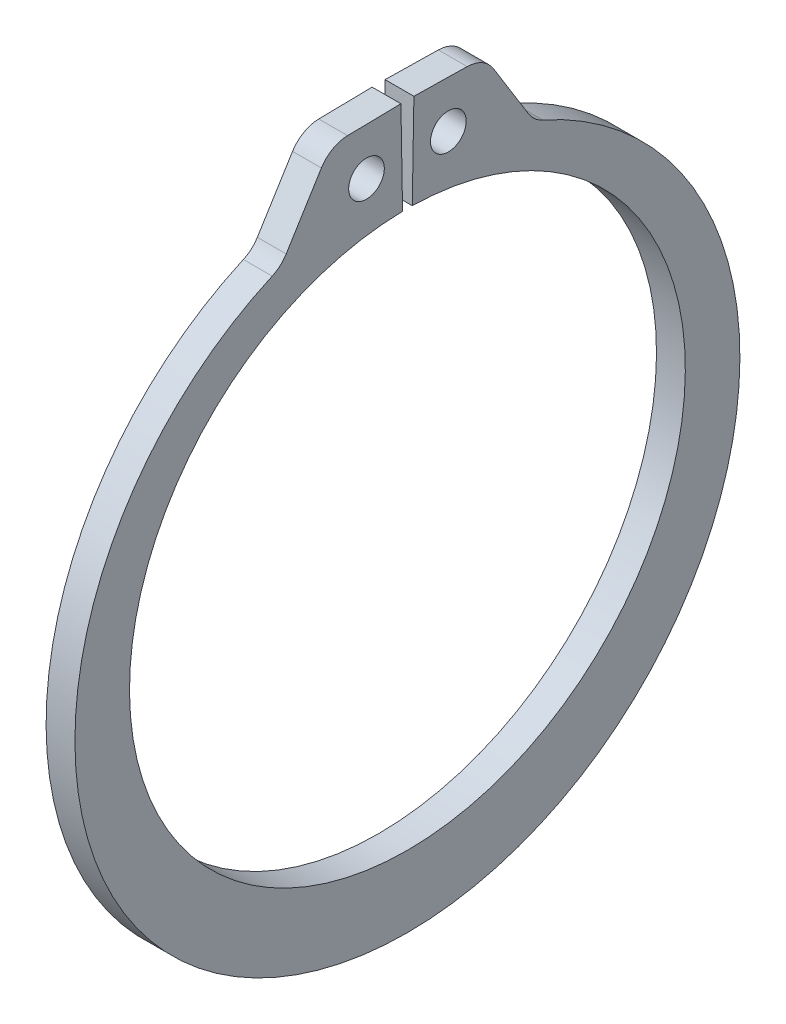
ISO-10303-21;
HEADER;
FILE_DESCRIPTION(('STEP AP214'),'2;1');
FILE_NAME('part.step','',(''),(''),'','','');
FILE_SCHEMA(('AUTOMOTIVE_DESIGN { 1 0 10303 214 1 1 1 1 }'));
ENDSEC;
DATA;
#1=APPLICATION_CONTEXT('core data for automotive mechanical design processes');
#2=APPLICATION_PROTOCOL_DEFINITION('international standard','automotive_design',2000,#1);
#3=PRODUCT_CONTEXT('',#1,'mechanical');
#4=PRODUCT('Part','Part','',(#3));
#5=PRODUCT_RELATED_PRODUCT_CATEGORY('part','',(#4));
#6=PRODUCT_DEFINITION_FORMATION('','',#4);
#7=PRODUCT_DEFINITION_CONTEXT('part definition',#1,'design');
#8=PRODUCT_DEFINITION('design','',#6,#7);
#9=PRODUCT_DEFINITION_SHAPE('','',#8);
#10=(LENGTH_UNIT() NAMED_UNIT(*) SI_UNIT(.MILLI.,.METRE.));
#11=(NAMED_UNIT(*) PLANE_ANGLE_UNIT() SI_UNIT($,.RADIAN.));
#12=(NAMED_UNIT(*) SI_UNIT($,.STERADIAN.) SOLID_ANGLE_UNIT());
#13=UNCERTAINTY_MEASURE_WITH_UNIT(LENGTH_MEASURE(1.E-05),#10,'distance_accuracy_value','');
#14=(GEOMETRIC_REPRESENTATION_CONTEXT(3) GLOBAL_UNCERTAINTY_ASSIGNED_CONTEXT((#13)) GLOBAL_UNIT_ASSIGNED_CONTEXT((#10,
#11,#12)) REPRESENTATION_CONTEXT('',''));
#15=CARTESIAN_POINT('',(0.,0.,0.));
#16=DIRECTION('',(0.,0.,1.));
#17=DIRECTION('',(1.,0.,0.));
#18=AXIS2_PLACEMENT_3D('',#15,#16,#17);
#19=CARTESIAN_POINT('',(0.5334,0.,0.));
#20=DIRECTION('',(1.,0.,0.));
#21=DIRECTION('',(0.,0.,-1.));
#22=AXIS2_PLACEMENT_3D('',#19,#20,#21);
#23=PLANE('',#22);
#24=CARTESIAN_POINT('',(0.5334,12.0022941634062,1.5146246005825));
#25=DIRECTION('',(1.,0.,0.));
#26=DIRECTION('',(0.,0.,-1.));
#27=AXIS2_PLACEMENT_3D('',#24,#25,#26);
#28=CIRCLE('',#27,0.6604);
#29=CARTESIAN_POINT('',(0.5334,12.0022941634062,0.8542246005825));
#30=VERTEX_POINT('',#29);
#31=EDGE_CURVE('E218',#30,#30,#28,.T.);
#32=ORIENTED_EDGE('',*,*,#31,.F.);
#33=EDGE_LOOP('',(#32));
#34=FACE_BOUND('',#33,.T.);
#35=DIRECTION('',(0.,-0.0174524064372796,0.999847695156391));
#36=VECTOR('',#35,1.);
#37=CARTESIAN_POINT('',(0.5334,13.764703249679,0.240263788940795));
#38=LINE('',#37,#36);
#39=CARTESIAN_POINT('',(0.5334,13.764703249679,0.240263788940795));
#40=VERTEX_POINT('',#39);
#41=CARTESIAN_POINT('',(0.5334,13.7302813096865,2.2122954103674));
#42=VERTEX_POINT('',#41);
#43=EDGE_CURVE('E130',#40,#42,#38,.T.);
#44=ORIENTED_EDGE('',*,*,#43,.T.);
#45=CARTESIAN_POINT('',(0.5334,12.5620592626658,2.19190401868609));
#46=DIRECTION('',(1.,0.,0.));
#47=DIRECTION('',(0.,0.,-1.));
#48=AXIS2_PLACEMENT_3D('',#45,#46,#47);
#49=CIRCLE('',#48,1.1684);
#50=CARTESIAN_POINT('',(0.5334,13.1771180937849,3.1853128943573));
#51=VERTEX_POINT('',#50);
#52=EDGE_CURVE('E171',#42,#51,#49,.T.);
#53=ORIENTED_EDGE('',*,*,#52,.T.);
#54=DIRECTION('',(0.,-0.850230122964068,0.526411187195434));
#55=VECTOR('',#54,1.);
#56=CARTESIAN_POINT('',(0.5334,13.7191550867387,2.8497162961447));
#57=LINE('',#56,#55);
#58=CARTESIAN_POINT('',(0.5334,11.0741234414696,4.48736028328253));
#59=VERTEX_POINT('',#58);
#60=EDGE_CURVE('E210',#51,#59,#57,.T.);
#61=ORIENTED_EDGE('',*,*,#60,.T.);
#62=CARTESIAN_POINT('',(0.5334,11.6891822725888,5.48076915895375));
#63=DIRECTION('',(1.,0.,0.));
#64=DIRECTION('',(0.,0.,-1.));
#65=AXIS2_PLACEMENT_3D('',#62,#63,#64);
#66=CIRCLE('',#65,1.1684);
#67=CARTESIAN_POINT('',(0.5334,10.6217868347989,5.00555811174905));
#68=VERTEX_POINT('',#67);
#69=EDGE_CURVE('E178',#59,#68,#66,.F.);
#70=ORIENTED_EDGE('',*,*,#69,.T.);
#71=CARTESIAN_POINT('',(0.5334,-0.621449035876219,0.));
#72=DIRECTION('',(1.,0.,0.));
#73=DIRECTION('',(0.,0.,-1.));
#74=AXIS2_PLACEMENT_3D('',#71,#72,#73);
#75=CIRCLE('',#74,12.3071509641238);
#76=CARTESIAN_POINT('',(0.5334,10.6217868347989,-5.00555811174905));
#77=VERTEX_POINT('',#76);
#78=EDGE_CURVE('E203',#68,#77,#75,.T.);
#79=ORIENTED_EDGE('',*,*,#78,.T.);
#80=CARTESIAN_POINT('',(0.5334,11.6891822725888,-5.48076915895375));
#81=DIRECTION('',(1.,0.,0.));
#82=DIRECTION('',(0.,0.,-1.));
#83=AXIS2_PLACEMENT_3D('',#80,#81,#82);
#84=CIRCLE('',#83,1.1684);
#85=CARTESIAN_POINT('',(0.5334,11.0741234414696,-4.48736028328253));
#86=VERTEX_POINT('',#85);
#87=EDGE_CURVE('E11',#77,#86,#84,.F.);
#88=ORIENTED_EDGE('',*,*,#87,.T.);
#89=DIRECTION('',(0.,0.850230122964068,0.526411187195434));
#90=VECTOR('',#89,1.);
#91=CARTESIAN_POINT('',(0.5334,13.7191550867387,-2.8497162961447));
#92=LINE('',#91,#90);
#93=CARTESIAN_POINT('',(0.5334,13.1771180937849,-3.1853128943573));
#94=VERTEX_POINT('',#93);
#95=EDGE_CURVE('E202',#86,#94,#92,.T.);
#96=ORIENTED_EDGE('',*,*,#95,.T.);
#97=CARTESIAN_POINT('',(0.5334,12.5620592626658,-2.19190401868609));
#98=DIRECTION('',(1.,0.,0.));
#99=DIRECTION('',(0.,0.,-1.));
#100=AXIS2_PLACEMENT_3D('',#97,#98,#99);
#101=CIRCLE('',#100,1.1684);
#102=CARTESIAN_POINT('',(0.5334,13.7302813096865,-2.2122954103674));
#103=VERTEX_POINT('',#102);
#104=EDGE_CURVE('E46',#94,#103,#101,.T.);
#105=ORIENTED_EDGE('',*,*,#104,.T.);
#106=DIRECTION('',(0.,0.0174524064372796,0.999847695156391));
#107=VECTOR('',#106,1.);
#108=CARTESIAN_POINT('',(0.5334,13.764703249679,-0.240263788940795));
#109=LINE('',#108,#107);
#110=CARTESIAN_POINT('',(0.5334,13.764703249679,-0.240263788940795));
#111=VERTEX_POINT('',#110);
#112=EDGE_CURVE('E207',#103,#111,#109,.T.);
#113=ORIENTED_EDGE('',*,*,#112,.T.);
#114=DIRECTION('',(0.,-0.999847695156391,0.0174524064372834));
#115=VECTOR('',#114,1.);
#116=CARTESIAN_POINT('',(0.5334,10.2854332400738,-0.179532905020336));
#117=LINE('',#116,#115);
#118=CARTESIAN_POINT('',(0.5334,10.2854332400738,-0.179532905020336));
#119=VERTEX_POINT('',#118);
#120=EDGE_CURVE('E136',#111,#119,#117,.T.);
#121=ORIENTED_EDGE('',*,*,#120,.T.);
#122=CARTESIAN_POINT('',(0.5334,0.,0.));
#123=DIRECTION('',(-1.,0.,0.));
#124=DIRECTION('',(0.,0.,-1.));
#125=AXIS2_PLACEMENT_3D('',#122,#123,#124);
#126=CIRCLE('',#125,10.287);
#127=CARTESIAN_POINT('',(0.5334,10.2854332400738,0.179532905020336));
#128=VERTEX_POINT('',#127);
#129=EDGE_CURVE('E131',#119,#128,#126,.T.);
#130=ORIENTED_EDGE('',*,*,#129,.T.);
#131=DIRECTION('',(0.,0.999847695156391,0.0174524064372834));
#132=VECTOR('',#131,1.);
#133=CARTESIAN_POINT('',(0.5334,10.2854332400738,0.179532905020336));
#134=LINE('',#133,#132);
#135=EDGE_CURVE('E122',#128,#40,#134,.T.);
#136=ORIENTED_EDGE('',*,*,#135,.T.);
#137=EDGE_LOOP('',(#44,#53,#61,#70,#79,#88,#96,#105,#113,#121,#130,#136));
#138=FACE_BOUND('',#137,.T.);
#139=CARTESIAN_POINT('',(0.5334,12.0022941634062,-1.5146246005825));
#140=DIRECTION('',(1.,0.,0.));
#141=DIRECTION('',(0.,0.,-1.));
#142=AXIS2_PLACEMENT_3D('',#139,#140,#141);
#143=CIRCLE('',#142,0.6604);
#144=CARTESIAN_POINT('',(0.5334,12.0022941634062,-2.1750246005825));
#145=VERTEX_POINT('',#144);
#146=EDGE_CURVE('E244',#145,#145,#143,.T.);
#147=ORIENTED_EDGE('',*,*,#146,.F.);
#148=EDGE_LOOP('',(#147));
#149=FACE_BOUND('',#148,.T.);
#150=ADVANCED_FACE('F31',(#34,#138,#149),#23,.T.);
#151=CARTESIAN_POINT('',(-0.5334,0.,0.));
#152=DIRECTION('',(1.,0.,0.));
#153=DIRECTION('',(0.,0.,-1.));
#154=AXIS2_PLACEMENT_3D('',#151,#152,#153);
#155=PLANE('',#154);
#156=CARTESIAN_POINT('',(-0.5334,12.0022941634062,1.5146246005825));
#157=DIRECTION('',(1.,0.,0.));
#158=DIRECTION('',(0.,0.,-1.));
#159=AXIS2_PLACEMENT_3D('',#156,#157,#158);
#160=CIRCLE('',#159,0.6604);
#161=CARTESIAN_POINT('',(-0.5334,12.0022941634062,0.8542246005825));
#162=VERTEX_POINT('',#161);
#163=EDGE_CURVE('E241',#162,#162,#160,.T.);
#164=ORIENTED_EDGE('',*,*,#163,.T.);
#165=EDGE_LOOP('',(#164));
#166=FACE_BOUND('',#165,.T.);
#167=DIRECTION('',(0.,-0.850230122964068,0.526411187195434));
#168=VECTOR('',#167,1.);
#169=CARTESIAN_POINT('',(-0.5334,13.7191550867387,2.8497162961447));
#170=LINE('',#169,#168);
#171=CARTESIAN_POINT('',(-0.5334,13.1771180937849,3.1853128943573));
#172=VERTEX_POINT('',#171);
#173=CARTESIAN_POINT('',(-0.5334,11.0741234414696,4.48736028328253));
#174=VERTEX_POINT('',#173);
#175=EDGE_CURVE('E197',#172,#174,#170,.T.);
#176=ORIENTED_EDGE('',*,*,#175,.F.);
#177=CARTESIAN_POINT('',(-0.5334,12.5620592626658,2.19190401868609));
#178=DIRECTION('',(1.,0.,0.));
#179=DIRECTION('',(0.,0.,-1.));
#180=AXIS2_PLACEMENT_3D('',#177,#178,#179);
#181=CIRCLE('',#180,1.1684);
#182=CARTESIAN_POINT('',(-0.5334,13.7302813096865,2.2122954103674));
#183=VERTEX_POINT('',#182);
#184=EDGE_CURVE('E167',#172,#183,#181,.F.);
#185=ORIENTED_EDGE('',*,*,#184,.T.);
#186=DIRECTION('',(0.,-0.0174524064372796,0.999847695156391));
#187=VECTOR('',#186,1.);
#188=CARTESIAN_POINT('',(-0.5334,13.764703249679,0.240263788940795));
#189=LINE('',#188,#187);
#190=CARTESIAN_POINT('',(-0.5334,13.764703249679,0.240263788940795));
#191=VERTEX_POINT('',#190);
#192=EDGE_CURVE('E220',#191,#183,#189,.T.);
#193=ORIENTED_EDGE('',*,*,#192,.F.);
#194=DIRECTION('',(0.,0.999847695156391,0.0174524064372834));
#195=VECTOR('',#194,1.);
#196=CARTESIAN_POINT('',(-0.5334,10.2854332400738,0.179532905020336));
#197=LINE('',#196,#195);
#198=CARTESIAN_POINT('',(-0.5334,10.2854332400738,0.179532905020336));
#199=VERTEX_POINT('',#198);
#200=EDGE_CURVE('E217',#199,#191,#197,.T.);
#201=ORIENTED_EDGE('',*,*,#200,.F.);
#202=CARTESIAN_POINT('',(-0.5334,0.,0.));
#203=DIRECTION('',(-1.,0.,0.));
#204=DIRECTION('',(0.,0.,-1.));
#205=AXIS2_PLACEMENT_3D('',#202,#203,#204);
#206=CIRCLE('',#205,10.287);
#207=CARTESIAN_POINT('',(-0.5334,10.2854332400738,-0.179532905020336));
#208=VERTEX_POINT('',#207);
#209=EDGE_CURVE('E144',#208,#199,#206,.T.);
#210=ORIENTED_EDGE('',*,*,#209,.F.);
#211=DIRECTION('',(0.,-0.999847695156391,0.0174524064372834));
#212=VECTOR('',#211,1.);
#213=CARTESIAN_POINT('',(-0.5334,10.2854332400738,-0.179532905020336));
#214=LINE('',#213,#212);
#215=CARTESIAN_POINT('',(-0.5334,13.764703249679,-0.240263788940795));
#216=VERTEX_POINT('',#215);
#217=EDGE_CURVE('E140',#216,#208,#214,.T.);
#218=ORIENTED_EDGE('',*,*,#217,.F.);
#219=DIRECTION('',(0.,0.0174524064372796,0.999847695156391));
#220=VECTOR('',#219,1.);
#221=CARTESIAN_POINT('',(-0.5334,13.764703249679,-0.240263788940795));
#222=LINE('',#221,#220);
#223=CARTESIAN_POINT('',(-0.5334,13.7302813096865,-2.2122954103674));
#224=VERTEX_POINT('',#223);
#225=EDGE_CURVE('E225',#224,#216,#222,.T.);
#226=ORIENTED_EDGE('',*,*,#225,.F.);
#227=CARTESIAN_POINT('',(-0.5334,12.5620592626658,-2.19190401868609));
#228=DIRECTION('',(1.,0.,0.));
#229=DIRECTION('',(0.,0.,-1.));
#230=AXIS2_PLACEMENT_3D('',#227,#228,#229);
#231=CIRCLE('',#230,1.1684);
#232=CARTESIAN_POINT('',(-0.5334,13.1771180937849,-3.1853128943573));
#233=VERTEX_POINT('',#232);
#234=EDGE_CURVE('E165',#224,#233,#231,.F.);
#235=ORIENTED_EDGE('',*,*,#234,.T.);
#236=DIRECTION('',(0.,0.850230122964068,0.526411187195434));
#237=VECTOR('',#236,1.);
#238=CARTESIAN_POINT('',(-0.5334,13.7191550867387,-2.8497162961447));
#239=LINE('',#238,#237);
#240=CARTESIAN_POINT('',(-0.5334,11.0741234414696,-4.48736028328253));
#241=VERTEX_POINT('',#240);
#242=EDGE_CURVE('E188',#241,#233,#239,.T.);
#243=ORIENTED_EDGE('',*,*,#242,.F.);
#244=CARTESIAN_POINT('',(-0.5334,11.6891822725888,-5.48076915895375));
#245=DIRECTION('',(1.,0.,0.));
#246=DIRECTION('',(0.,0.,-1.));
#247=AXIS2_PLACEMENT_3D('',#244,#245,#246);
#248=CIRCLE('',#247,1.1684);
#249=CARTESIAN_POINT('',(-0.5334,10.6217868347989,-5.00555811174905));
#250=VERTEX_POINT('',#249);
#251=EDGE_CURVE('E39',#241,#250,#248,.T.);
#252=ORIENTED_EDGE('',*,*,#251,.T.);
#253=CARTESIAN_POINT('',(-0.5334,-0.621449035876219,0.));
#254=DIRECTION('',(1.,0.,0.));
#255=DIRECTION('',(0.,0.,-1.));
#256=AXIS2_PLACEMENT_3D('',#253,#254,#255);
#257=CIRCLE('',#256,12.3071509641238);
#258=CARTESIAN_POINT('',(-0.5334,10.6217868347989,5.00555811174905));
#259=VERTEX_POINT('',#258);
#260=EDGE_CURVE('E186',#259,#250,#257,.T.);
#261=ORIENTED_EDGE('',*,*,#260,.F.);
#262=CARTESIAN_POINT('',(-0.5334,11.6891822725888,5.48076915895375));
#263=DIRECTION('',(1.,0.,0.));
#264=DIRECTION('',(0.,0.,-1.));
#265=AXIS2_PLACEMENT_3D('',#262,#263,#264);
#266=CIRCLE('',#265,1.1684);
#267=EDGE_CURVE('E176',#259,#174,#266,.T.);
#268=ORIENTED_EDGE('',*,*,#267,.T.);
#269=EDGE_LOOP('',(#176,#185,#193,#201,#210,#218,#226,#235,#243,#252,#261,#268));
#270=FACE_BOUND('',#269,.T.);
#271=CARTESIAN_POINT('',(-0.5334,12.0022941634062,-1.5146246005825));
#272=DIRECTION('',(1.,0.,0.));
#273=DIRECTION('',(0.,0.,-1.));
#274=AXIS2_PLACEMENT_3D('',#271,#272,#273);
#275=CIRCLE('',#274,0.6604);
#276=CARTESIAN_POINT('',(-0.5334,12.0022941634062,-2.1750246005825));
#277=VERTEX_POINT('',#276);
#278=EDGE_CURVE('E247',#277,#277,#275,.T.);
#279=ORIENTED_EDGE('',*,*,#278,.T.);
#280=EDGE_LOOP('',(#279));
#281=FACE_BOUND('',#280,.T.);
#282=ADVANCED_FACE('F184',(#166,#270,#281),#155,.F.);
#283=CARTESIAN_POINT('',(0.5334,0.,0.));
#284=DIRECTION('',(-1.,0.,0.));
#285=DIRECTION('',(0.,0.,1.));
#286=AXIS2_PLACEMENT_3D('',#283,#284,#285);
#287=CYLINDRICAL_SURFACE('',#286,10.287);
#288=ORIENTED_EDGE('',*,*,#209,.T.);
#289=DIRECTION('',(-1.,0.,0.));
#290=VECTOR('',#289,1.);
#291=CARTESIAN_POINT('',(0.5334,10.2854332400738,0.179532905020336));
#292=LINE('',#291,#290);
#293=EDGE_CURVE('E126',#128,#199,#292,.T.);
#294=ORIENTED_EDGE('',*,*,#293,.F.);
#295=ORIENTED_EDGE('',*,*,#129,.F.);
#296=DIRECTION('',(-1.,0.,0.));
#297=VECTOR('',#296,1.);
#298=CARTESIAN_POINT('',(0.5334,10.2854332400738,-0.179532905020336));
#299=LINE('',#298,#297);
#300=EDGE_CURVE('E215',#119,#208,#299,.T.);
#301=ORIENTED_EDGE('',*,*,#300,.T.);
#302=EDGE_LOOP('',(#288,#294,#295,#301));
#303=FACE_BOUND('',#302,.T.);
#304=ADVANCED_FACE('F142',(#303),#287,.F.);
#305=CARTESIAN_POINT('',(0.5334,10.2854332400738,0.179532905020336));
#306=DIRECTION('',(0.,-0.0174524064372834,0.999847695156391));
#307=DIRECTION('',(0.,-0.999847695156391,-0.0174524064372834));
#308=AXIS2_PLACEMENT_3D('',#305,#306,#307);
#309=PLANE('',#308);
#310=ORIENTED_EDGE('',*,*,#200,.T.);
#311=DIRECTION('',(-1.,0.,0.));
#312=VECTOR('',#311,1.);
#313=CARTESIAN_POINT('',(0.5334,13.764703249679,0.240263788940795));
#314=LINE('',#313,#312);
#315=EDGE_CURVE('E129',#40,#191,#314,.T.);
#316=ORIENTED_EDGE('',*,*,#315,.F.);
#317=ORIENTED_EDGE('',*,*,#135,.F.);
#318=ORIENTED_EDGE('',*,*,#293,.T.);
#319=EDGE_LOOP('',(#310,#316,#317,#318));
#320=FACE_BOUND('',#319,.T.);
#321=ADVANCED_FACE('F124',(#320),#309,.F.);
#322=CARTESIAN_POINT('',(0.5334,13.764703249679,0.240263788940795));
#323=DIRECTION('',(0.,-0.999847695156391,-0.0174524064372796));
#324=DIRECTION('',(0.,0.0174524064372796,-0.999847695156391));
#325=AXIS2_PLACEMENT_3D('',#322,#323,#324);
#326=PLANE('',#325);
#327=ORIENTED_EDGE('',*,*,#192,.T.);
#328=DIRECTION('',(-1.,0.,0.));
#329=VECTOR('',#328,1.);
#330=CARTESIAN_POINT('',(0.5334,13.7302813096865,2.2122954103674));
#331=LINE('',#330,#329);
#332=EDGE_CURVE('E54',#183,#42,#331,.F.);
#333=ORIENTED_EDGE('',*,*,#332,.T.);
#334=ORIENTED_EDGE('',*,*,#43,.F.);
#335=ORIENTED_EDGE('',*,*,#315,.T.);
#336=EDGE_LOOP('',(#327,#333,#334,#335));
#337=FACE_BOUND('',#336,.T.);
#338=ADVANCED_FACE('F236',(#337),#326,.F.);
#339=CARTESIAN_POINT('',(0.5334,13.7191550867387,2.8497162961447));
#340=DIRECTION('',(0.,-0.526411187195434,-0.850230122964068));
#341=DIRECTION('',(0.,0.850230122964068,-0.526411187195434));
#342=AXIS2_PLACEMENT_3D('',#339,#340,#341);
#343=PLANE('',#342);
#344=ORIENTED_EDGE('',*,*,#175,.T.);
#345=DIRECTION('',(1.,0.,0.));
#346=VECTOR('',#345,1.);
#347=CARTESIAN_POINT('',(0.5334,11.0741234414696,4.48736028328253));
#348=LINE('',#347,#346);
#349=EDGE_CURVE('E158',#174,#59,#348,.T.);
#350=ORIENTED_EDGE('',*,*,#349,.T.);
#351=ORIENTED_EDGE('',*,*,#60,.F.);
#352=DIRECTION('',(-1.,0.,0.));
#353=VECTOR('',#352,1.);
#354=CARTESIAN_POINT('',(0.5334,13.1771180937849,3.1853128943573));
#355=LINE('',#354,#353);
#356=EDGE_CURVE('E155',#51,#172,#355,.T.);
#357=ORIENTED_EDGE('',*,*,#356,.T.);
#358=EDGE_LOOP('',(#344,#350,#351,#357));
#359=FACE_BOUND('',#358,.T.);
#360=ADVANCED_FACE('F277',(#359),#343,.F.);
#361=CARTESIAN_POINT('',(0.5334,-0.621449035876219,0.));
#362=DIRECTION('',(-1.,0.,0.));
#363=DIRECTION('',(0.,0.,1.));
#364=AXIS2_PLACEMENT_3D('',#361,#362,#363);
#365=CYLINDRICAL_SURFACE('',#364,12.3071509641238);
#366=ORIENTED_EDGE('',*,*,#78,.F.);
#367=DIRECTION('',(-1.,0.,0.));
#368=VECTOR('',#367,1.);
#369=CARTESIAN_POINT('',(0.5334,10.6217868347989,5.00555811174905));
#370=LINE('',#369,#368);
#371=EDGE_CURVE('E147',#68,#259,#370,.T.);
#372=ORIENTED_EDGE('',*,*,#371,.T.);
#373=ORIENTED_EDGE('',*,*,#260,.T.);
#374=DIRECTION('',(-1.,0.,0.));
#375=VECTOR('',#374,1.);
#376=CARTESIAN_POINT('',(0.5334,10.6217868347989,-5.00555811174905));
#377=LINE('',#376,#375);
#378=EDGE_CURVE('E145',#250,#77,#377,.F.);
#379=ORIENTED_EDGE('',*,*,#378,.T.);
#380=EDGE_LOOP('',(#366,#372,#373,#379));
#381=FACE_BOUND('',#380,.T.);
#382=ADVANCED_FACE('F194',(#381),#365,.T.);
#383=CARTESIAN_POINT('',(0.5334,13.7191550867387,-2.8497162961447));
#384=DIRECTION('',(0.,-0.526411187195434,0.850230122964068));
#385=DIRECTION('',(0.,-0.850230122964068,-0.526411187195434));
#386=AXIS2_PLACEMENT_3D('',#383,#384,#385);
#387=PLANE('',#386);
#388=ORIENTED_EDGE('',*,*,#95,.F.);
#389=DIRECTION('',(1.,0.,0.));
#390=VECTOR('',#389,1.);
#391=CARTESIAN_POINT('',(-0.5334,11.0741234414696,-4.48736028328253));
#392=LINE('',#391,#390);
#393=EDGE_CURVE('E162',#86,#241,#392,.F.);
#394=ORIENTED_EDGE('',*,*,#393,.T.);
#395=ORIENTED_EDGE('',*,*,#242,.T.);
#396=DIRECTION('',(-1.,0.,0.));
#397=VECTOR('',#396,1.);
#398=CARTESIAN_POINT('',(0.5334,13.1771180937849,-3.1853128943573));
#399=LINE('',#398,#397);
#400=EDGE_CURVE('E160',#233,#94,#399,.F.);
#401=ORIENTED_EDGE('',*,*,#400,.T.);
#402=EDGE_LOOP('',(#388,#394,#395,#401));
#403=FACE_BOUND('',#402,.T.);
#404=ADVANCED_FACE('F205',(#403),#387,.F.);
#405=CARTESIAN_POINT('',(0.5334,13.764703249679,-0.240263788940795));
#406=DIRECTION('',(0.,-0.999847695156391,0.0174524064372796));
#407=DIRECTION('',(0.,-0.0174524064372796,-0.999847695156391));
#408=AXIS2_PLACEMENT_3D('',#405,#406,#407);
#409=PLANE('',#408);
#410=ORIENTED_EDGE('',*,*,#112,.F.);
#411=DIRECTION('',(-1.,0.,0.));
#412=VECTOR('',#411,1.);
#413=CARTESIAN_POINT('',(0.5334,13.7302813096865,-2.2122954103674));
#414=LINE('',#413,#412);
#415=EDGE_CURVE('E173',#103,#224,#414,.T.);
#416=ORIENTED_EDGE('',*,*,#415,.T.);
#417=ORIENTED_EDGE('',*,*,#225,.T.);
#418=DIRECTION('',(-1.,0.,0.));
#419=VECTOR('',#418,1.);
#420=CARTESIAN_POINT('',(0.5334,13.764703249679,-0.240263788940795));
#421=LINE('',#420,#419);
#422=EDGE_CURVE('E149',#111,#216,#421,.T.);
#423=ORIENTED_EDGE('',*,*,#422,.F.);
#424=EDGE_LOOP('',(#410,#416,#417,#423));
#425=FACE_BOUND('',#424,.T.);
#426=ADVANCED_FACE('F270',(#425),#409,.F.);
#427=CARTESIAN_POINT('',(0.5334,10.2854332400738,-0.179532905020336));
#428=DIRECTION('',(0.,-0.0174524064372834,-0.999847695156391));
#429=DIRECTION('',(0.,0.999847695156391,-0.0174524064372834));
#430=AXIS2_PLACEMENT_3D('',#427,#428,#429);
#431=PLANE('',#430);
#432=ORIENTED_EDGE('',*,*,#217,.T.);
#433=ORIENTED_EDGE('',*,*,#300,.F.);
#434=ORIENTED_EDGE('',*,*,#120,.F.);
#435=ORIENTED_EDGE('',*,*,#422,.T.);
#436=EDGE_LOOP('',(#432,#433,#434,#435));
#437=FACE_BOUND('',#436,.T.);
#438=ADVANCED_FACE('F232',(#437),#431,.F.);
#439=CARTESIAN_POINT('',(0.5334,12.0022941634062,1.5146246005825));
#440=DIRECTION('',(-1.,0.,0.));
#441=DIRECTION('',(0.,0.,1.));
#442=AXIS2_PLACEMENT_3D('',#439,#440,#441);
#443=CYLINDRICAL_SURFACE('',#442,0.6604);
#444=ORIENTED_EDGE('',*,*,#31,.T.);
#445=EDGE_LOOP('',(#444));
#446=FACE_BOUND('',#445,.T.);
#447=ORIENTED_EDGE('',*,*,#163,.F.);
#448=EDGE_LOOP('',(#447));
#449=FACE_BOUND('',#448,.T.);
#450=ADVANCED_FACE('F265',(#446,#449),#443,.F.);
#451=CARTESIAN_POINT('',(0.5334,12.0022941634062,-1.5146246005825));
#452=DIRECTION('',(-1.,0.,0.));
#453=DIRECTION('',(0.,0.,1.));
#454=AXIS2_PLACEMENT_3D('',#451,#452,#453);
#455=CYLINDRICAL_SURFACE('',#454,0.6604);
#456=ORIENTED_EDGE('',*,*,#146,.T.);
#457=EDGE_LOOP('',(#456));
#458=FACE_BOUND('',#457,.T.);
#459=ORIENTED_EDGE('',*,*,#278,.F.);
#460=EDGE_LOOP('',(#459));
#461=FACE_BOUND('',#460,.T.);
#462=ADVANCED_FACE('F253',(#458,#461),#455,.F.);
#463=CARTESIAN_POINT('',(0.5334,11.6891822725888,5.48076915895375));
#464=DIRECTION('',(-1.,0.,0.));
#465=DIRECTION('',(0.,0.,1.));
#466=AXIS2_PLACEMENT_3D('',#463,#464,#465);
#467=CYLINDRICAL_SURFACE('',#466,1.1684);
#468=ORIENTED_EDGE('',*,*,#69,.F.);
#469=ORIENTED_EDGE('',*,*,#349,.F.);
#470=ORIENTED_EDGE('',*,*,#267,.F.);
#471=ORIENTED_EDGE('',*,*,#371,.F.);
#472=EDGE_LOOP('',(#468,#469,#470,#471));
#473=FACE_BOUND('',#472,.T.);
#474=ADVANCED_FACE('F287',(#473),#467,.F.);
#475=CARTESIAN_POINT('',(0.5334,11.6891822725888,-5.48076915895375));
#476=DIRECTION('',(-1.,0.,0.));
#477=DIRECTION('',(0.,0.,1.));
#478=AXIS2_PLACEMENT_3D('',#475,#476,#477);
#479=CYLINDRICAL_SURFACE('',#478,1.1684);
#480=ORIENTED_EDGE('',*,*,#87,.F.);
#481=ORIENTED_EDGE('',*,*,#378,.F.);
#482=ORIENTED_EDGE('',*,*,#251,.F.);
#483=ORIENTED_EDGE('',*,*,#393,.F.);
#484=EDGE_LOOP('',(#480,#481,#482,#483));
#485=FACE_BOUND('',#484,.T.);
#486=ADVANCED_FACE('F200',(#485),#479,.F.);
#487=CARTESIAN_POINT('',(0.5334,12.5620592626658,2.19190401868609));
#488=DIRECTION('',(-1.,0.,0.));
#489=DIRECTION('',(0.,0.,1.));
#490=AXIS2_PLACEMENT_3D('',#487,#488,#489);
#491=CYLINDRICAL_SURFACE('',#490,1.1684);
#492=ORIENTED_EDGE('',*,*,#52,.F.);
#493=ORIENTED_EDGE('',*,*,#332,.F.);
#494=ORIENTED_EDGE('',*,*,#184,.F.);
#495=ORIENTED_EDGE('',*,*,#356,.F.);
#496=EDGE_LOOP('',(#492,#493,#494,#495));
#497=FACE_BOUND('',#496,.T.);
#498=ADVANCED_FACE('F292',(#497),#491,.T.);
#499=CARTESIAN_POINT('',(0.5334,12.5620592626658,-2.19190401868609));
#500=DIRECTION('',(-1.,0.,0.));
#501=DIRECTION('',(0.,0.,1.));
#502=AXIS2_PLACEMENT_3D('',#499,#500,#501);
#503=CYLINDRICAL_SURFACE('',#502,1.1684);
#504=ORIENTED_EDGE('',*,*,#104,.F.);
#505=ORIENTED_EDGE('',*,*,#400,.F.);
#506=ORIENTED_EDGE('',*,*,#234,.F.);
#507=ORIENTED_EDGE('',*,*,#415,.F.);
#508=EDGE_LOOP('',(#504,#505,#506,#507));
#509=FACE_BOUND('',#508,.T.);
#510=ADVANCED_FACE('F33',(#509),#503,.T.);
#511=CLOSED_SHELL('',(#150,#282,#304,#321,#338,#360,#382,#404,#426,#438,#450,#462,#474,#486,
#498,#510));
#512=MANIFOLD_SOLID_BREP('B2',#511);
#513=ADVANCED_BREP_SHAPE_REPRESENTATION('',(#18,#512),#14);
#514=SHAPE_DEFINITION_REPRESENTATION(#9,#513);
ENDSEC;
END-ISO-10303-21;
